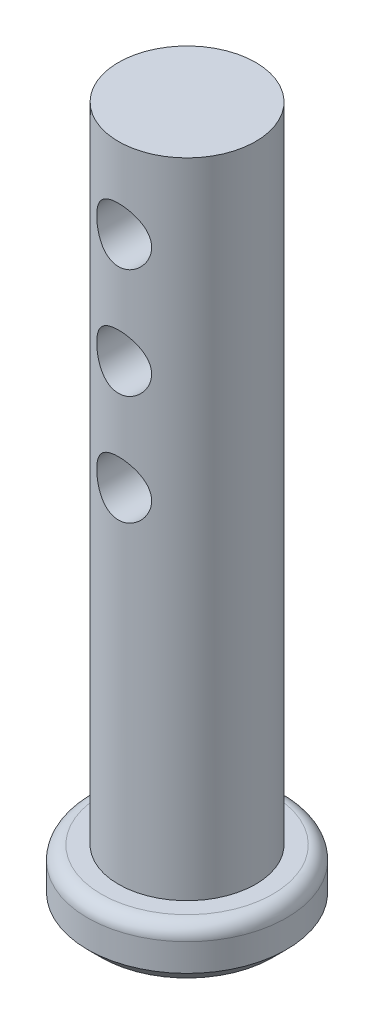
ISO-10303-21;
HEADER;
FILE_DESCRIPTION(('STEP AP214'),'2;1');
FILE_NAME('part.step','',(''),(''),'','','');
FILE_SCHEMA(('AUTOMOTIVE_DESIGN { 1 0 10303 214 1 1 1 1 }'));
ENDSEC;
DATA;
#1=APPLICATION_CONTEXT('core data for automotive mechanical design processes');
#2=APPLICATION_PROTOCOL_DEFINITION('international standard','automotive_design',2000,#1);
#3=PRODUCT_CONTEXT('',#1,'mechanical');
#4=PRODUCT('Part','Part','',(#3));
#5=PRODUCT_RELATED_PRODUCT_CATEGORY('part','',(#4));
#6=PRODUCT_DEFINITION_FORMATION('','',#4);
#7=PRODUCT_DEFINITION_CONTEXT('part definition',#1,'design');
#8=PRODUCT_DEFINITION('design','',#6,#7);
#9=PRODUCT_DEFINITION_SHAPE('','',#8);
#10=(LENGTH_UNIT() NAMED_UNIT(*) SI_UNIT(.MILLI.,.METRE.));
#11=(NAMED_UNIT(*) PLANE_ANGLE_UNIT() SI_UNIT($,.RADIAN.));
#12=(NAMED_UNIT(*) SI_UNIT($,.STERADIAN.) SOLID_ANGLE_UNIT());
#13=UNCERTAINTY_MEASURE_WITH_UNIT(LENGTH_MEASURE(1.E-05),#10,'distance_accuracy_value','');
#14=(GEOMETRIC_REPRESENTATION_CONTEXT(3) GLOBAL_UNCERTAINTY_ASSIGNED_CONTEXT((#13)) GLOBAL_UNIT_ASSIGNED_CONTEXT((#10,
#11,#12)) REPRESENTATION_CONTEXT('',''));
#15=CARTESIAN_POINT('',(0.,0.,0.));
#16=DIRECTION('',(0.,0.,1.));
#17=DIRECTION('',(1.,0.,0.));
#18=AXIS2_PLACEMENT_3D('',#15,#16,#17);
#19=CARTESIAN_POINT('',(0.,2.54,0.));
#20=DIRECTION('',(0.,1.,0.));
#21=DIRECTION('',(0.,0.,1.));
#22=AXIS2_PLACEMENT_3D('',#19,#20,#21);
#23=PLANE('',#22);
#24=CARTESIAN_POINT('',(0.,2.54,0.));
#25=DIRECTION('',(0.,1.,0.));
#26=DIRECTION('',(0.,0.,1.));
#27=AXIS2_PLACEMENT_3D('',#24,#25,#26);
#28=CIRCLE('',#27,3.96875);
#29=CARTESIAN_POINT('',(0.,2.54,3.96875));
#30=VERTEX_POINT('',#29);
#31=EDGE_CURVE('E49',#30,#30,#28,.T.);
#32=ORIENTED_EDGE('',*,*,#31,.T.);
#33=EDGE_LOOP('',(#32));
#34=FACE_BOUND('',#33,.T.);
#35=CARTESIAN_POINT('',(0.,2.54,0.));
#36=DIRECTION('',(0.,1.,0.));
#37=DIRECTION('',(0.,0.,1.));
#38=AXIS2_PLACEMENT_3D('',#35,#36,#37);
#39=CIRCLE('',#38,3.175);
#40=CARTESIAN_POINT('',(0.,2.54,3.175));
#41=VERTEX_POINT('',#40);
#42=EDGE_CURVE('E52',#41,#41,#39,.T.);
#43=ORIENTED_EDGE('',*,*,#42,.F.);
#44=EDGE_LOOP('',(#43));
#45=FACE_BOUND('',#44,.T.);
#46=ADVANCED_FACE('F32',(#34,#45),#23,.T.);
#47=CARTESIAN_POINT('',(0.,2.54,0.));
#48=DIRECTION('',(0.,-1.,0.));
#49=DIRECTION('',(0.,0.,-1.));
#50=AXIS2_PLACEMENT_3D('',#47,#48,#49);
#51=CYLINDRICAL_SURFACE('',#50,4.60375);
#52=CARTESIAN_POINT('',(0.,0.635000000000004,0.));
#53=DIRECTION('',(0.,1.,0.));
#54=DIRECTION('',(0.,0.,1.));
#55=AXIS2_PLACEMENT_3D('',#52,#53,#54);
#56=CIRCLE('',#55,4.60375);
#57=CARTESIAN_POINT('',(0.,0.635000000000004,4.60375));
#58=VERTEX_POINT('',#57);
#59=EDGE_CURVE('E40',#58,#58,#56,.T.);
#60=ORIENTED_EDGE('',*,*,#59,.T.);
#61=EDGE_LOOP('',(#60));
#62=FACE_BOUND('',#61,.T.);
#63=CARTESIAN_POINT('',(0.,1.905,0.));
#64=DIRECTION('',(0.,1.,0.));
#65=DIRECTION('',(0.,0.,1.));
#66=AXIS2_PLACEMENT_3D('',#63,#64,#65);
#67=CIRCLE('',#66,4.60375);
#68=CARTESIAN_POINT('',(0.,1.905,4.60375));
#69=VERTEX_POINT('',#68);
#70=EDGE_CURVE('E44',#69,#69,#67,.F.);
#71=ORIENTED_EDGE('',*,*,#70,.T.);
#72=EDGE_LOOP('',(#71));
#73=FACE_BOUND('',#72,.T.);
#74=ADVANCED_FACE('F127',(#62,#73),#51,.T.);
#75=CARTESIAN_POINT('',(0.,0.,0.));
#76=DIRECTION('',(0.,1.,0.));
#77=DIRECTION('',(0.,0.,1.));
#78=AXIS2_PLACEMENT_3D('',#75,#76,#77);
#79=PLANE('',#78);
#80=CARTESIAN_POINT('',(0.,0.,0.));
#81=DIRECTION('',(0.,1.,0.));
#82=DIRECTION('',(0.,0.,1.));
#83=AXIS2_PLACEMENT_3D('',#80,#81,#82);
#84=CIRCLE('',#83,3.96875);
#85=CARTESIAN_POINT('',(0.,0.,3.96875));
#86=VERTEX_POINT('',#85);
#87=EDGE_CURVE('E10',#86,#86,#84,.F.);
#88=ORIENTED_EDGE('',*,*,#87,.T.);
#89=EDGE_LOOP('',(#88));
#90=FACE_BOUND('',#89,.T.);
#91=ADVANCED_FACE('F109',(#90),#79,.F.);
#92=CARTESIAN_POINT('',(0.,48.26,0.));
#93=DIRECTION('',(0.,-1.,0.));
#94=DIRECTION('',(0.,0.,-1.));
#95=AXIS2_PLACEMENT_3D('',#92,#93,#94);
#96=CYLINDRICAL_SURFACE('',#95,3.175);
#97=CARTESIAN_POINT('',(0.,32.3205337455157,0.));
#98=DIRECTION('',(0.,-1.,0.));
#99=DIRECTION('',(0.,0.,-1.));
#100=AXIS2_PLACEMENT_3D('',#97,#98,#99);
#101=CIRCLE('',#100,3.175);
#102=CARTESIAN_POINT('',(0.,32.3205337455157,-3.175));
#103=VERTEX_POINT('',#102);
#104=EDGE_CURVE('E36',#103,#103,#101,.T.);
#105=ORIENTED_EDGE('',*,*,#104,.T.);
#106=EDGE_LOOP('',(#105));
#107=FACE_BOUND('',#106,.T.);
#108=CARTESIAN_POINT('',(0.,29.845,-3.175));
#109=CARTESIAN_POINT('',(-0.068258058456236,29.8449937440919,-3.17499537229199));
#110=CARTESIAN_POINT('',(-0.136634578197578,29.8394642274239,-3.17277301884902));
#111=CARTESIAN_POINT('',(-0.271460265065364,29.817537708264,-3.16409992718907));
#112=CARTESIAN_POINT('',(-0.337903678751393,29.8011111627803,-3.15763769473787));
#113=CARTESIAN_POINT('',(-0.466695740931903,29.7580836904327,-3.1411812285033));
#114=CARTESIAN_POINT('',(-0.529057020126772,29.7315160726524,-3.13119856591186));
#115=CARTESIAN_POINT('',(-0.648380701158518,29.6690928249377,-3.10868447855509));
#116=CARTESIAN_POINT('',(-0.705344967736885,29.6332404191265,-3.09615393885866));
#117=CARTESIAN_POINT('',(-0.815023139807206,29.5514804584138,-3.06915112718216));
#118=CARTESIAN_POINT('',(-0.867449543069393,29.5052072732875,-3.05461858550036));
#119=CARTESIAN_POINT('',(-0.964041128038309,29.4046909977923,-3.02552466335433));
#120=CARTESIAN_POINT('',(-1.0082022680298,29.3504440312706,-3.01096327228158));
#121=CARTESIAN_POINT('',(-1.08894535023099,29.2325881753962,-2.98273972791181));
#122=CARTESIAN_POINT('',(-1.12510251305914,29.1686700813753,-2.96914643637744));
#123=CARTESIAN_POINT('',(-1.18602424658861,29.0350343870033,-2.94534365963612));
#124=CARTESIAN_POINT('',(-1.21079422832153,28.9653195598163,-2.93513256790051));
#125=CARTESIAN_POINT('',(-1.2470757528564,28.825372668169,-2.91989737114619));
#126=CARTESIAN_POINT('',(-1.25913766828662,28.7553074654091,-2.91465901925808));
#127=CARTESIAN_POINT('',(-1.27137983064145,28.6139667760749,-2.90934142571205));
#128=CARTESIAN_POINT('',(-1.27156592035893,28.5426919019132,-2.90925964706956));
#129=CARTESIAN_POINT('',(-1.26046824836542,28.4062445136242,-2.91408167677795));
#130=CARTESIAN_POINT('',(-1.2499818245838,28.3409925213503,-2.91863891149414));
#131=CARTESIAN_POINT('',(-1.21916626898916,28.2132661819358,-2.93164379130974));
#132=CARTESIAN_POINT('',(-1.19883541970099,28.15079232155,-2.9400921152426));
#133=CARTESIAN_POINT('',(-1.14852115516998,28.0288886740156,-2.96011273031215));
#134=CARTESIAN_POINT('',(-1.11834921257028,27.9695470332003,-2.97174525843298));
#135=CARTESIAN_POINT('',(-1.04934160256501,27.8565509566104,-2.99680703907578));
#136=CARTESIAN_POINT('',(-1.01050268123909,27.8028986680293,-3.01023696565097));
#137=CARTESIAN_POINT('',(-0.921734630653625,27.6984398222108,-3.0386447783134));
#138=CARTESIAN_POINT('',(-0.871180288986414,27.6481738568018,-3.05366207259854));
#139=CARTESIAN_POINT('',(-0.762199661418236,27.5566603564687,-3.08266988848507));
#140=CARTESIAN_POINT('',(-0.703771811487431,27.5154146176445,-3.0966602052278));
#141=CARTESIAN_POINT('',(-0.579169309404779,27.442402920891,-3.12238822602987));
#142=CARTESIAN_POINT('',(-0.512864412005083,27.4108403514399,-3.13407596510587));
#143=CARTESIAN_POINT('',(-0.375300091081701,27.3595034082154,-3.15350415988761));
#144=CARTESIAN_POINT('',(-0.304043204999614,27.3397230461511,-3.16124662048612));
#145=CARTESIAN_POINT('',(-0.163128888631037,27.3136053324085,-3.17154648586888));
#146=CARTESIAN_POINT('',(-0.0936264916808848,27.306541491549,-3.17438370604281));
#147=CARTESIAN_POINT('',(0.0456217717278951,27.3039121811643,-3.17543483854251));
#148=CARTESIAN_POINT('',(0.115367570397124,27.3083437312173,-3.17364994924755));
#149=CARTESIAN_POINT('',(0.249829789342396,27.3280452628705,-3.16584055085484));
#150=CARTESIAN_POINT('',(0.31463138227736,27.3428193175229,-3.16001013504408));
#151=CARTESIAN_POINT('',(0.440775996818531,27.3821116747767,-3.14489745292493));
#152=CARTESIAN_POINT('',(0.502118572992712,27.4066312290896,-3.13561474321398));
#153=CARTESIAN_POINT('',(0.621715028993544,27.4655184366968,-3.11414537679467));
#154=CARTESIAN_POINT('',(0.679817044449623,27.5001643747474,-3.10187858147177));
#155=CARTESIAN_POINT('',(0.789586680441504,27.5780121056801,-3.0757708661341));
#156=CARTESIAN_POINT('',(0.841251708883256,27.6212173272558,-3.06192931625023));
#157=CARTESIAN_POINT('',(0.940259132323243,27.718302458223,-3.03304649700203));
#158=CARTESIAN_POINT('',(0.987090947966796,27.7726987988564,-3.0179863530491));
#159=CARTESIAN_POINT('',(1.07108701035765,27.8888444527109,-2.98920962302381));
#160=CARTESIAN_POINT('',(1.10824966394927,27.9505949752158,-2.97549325859336));
#161=CARTESIAN_POINT('',(1.17208776372654,28.0806281760672,-2.95093580441397));
#162=CARTESIAN_POINT('',(1.19865812752933,28.1489683394998,-2.94012385611842));
#163=CARTESIAN_POINT('',(1.23970809951283,28.2897158688391,-2.92305532658488));
#164=CARTESIAN_POINT('',(1.25419663134598,28.3621201906909,-2.91679538366961));
#165=CARTESIAN_POINT('',(1.26981941697175,28.5033262176268,-2.91002567155455));
#166=CARTESIAN_POINT('',(1.27183964726229,28.5720122231417,-2.9091345234019));
#167=CARTESIAN_POINT('',(1.2647950061412,28.7086959846479,-2.91220420881018));
#168=CARTESIAN_POINT('',(1.25573154232522,28.7766938269281,-2.91616442626245));
#169=CARTESIAN_POINT('',(1.22750031750754,28.9073159405579,-2.92815422165179));
#170=CARTESIAN_POINT('',(1.20874630841755,28.9700463742649,-2.93601668210431));
#171=CARTESIAN_POINT('',(1.16205345979177,29.0914954298045,-2.95480740782763));
#172=CARTESIAN_POINT('',(1.13411208368505,29.1502129382814,-2.96573651965815));
#173=CARTESIAN_POINT('',(1.06798920435241,29.2656321082369,-2.99020617098853));
#174=CARTESIAN_POINT('',(1.02931298782626,29.3220258555328,-3.00386040268909));
#175=CARTESIAN_POINT('',(0.943541495737388,29.4278007564244,-3.03189515776371));
#176=CARTESIAN_POINT('',(0.896443682609497,29.4771797883015,-3.04627589910738));
#177=CARTESIAN_POINT('',(0.791530996483007,29.5708088118224,-3.07526415100495));
#178=CARTESIAN_POINT('',(0.733219260727793,29.6145186898803,-3.08982591305988));
#179=CARTESIAN_POINT('',(0.609536703381468,29.6915440220647,-3.1165825826321));
#180=CARTESIAN_POINT('',(0.544162617887495,29.7248546422168,-3.12877638843996));
#181=CARTESIAN_POINT('',(0.409408669684455,29.7793551066458,-3.14921718908072));
#182=CARTESIAN_POINT('',(0.340126077569508,29.8007591204608,-3.15753345539943));
#183=CARTESIAN_POINT('',(0.198676606888577,29.831435841806,-3.16956634442947));
#184=CARTESIAN_POINT('',(0.126519638920411,29.8407470473324,-3.1732975617973));
#185=CARTESIAN_POINT('',(0.0361393091607415,29.8446160669212,-3.17484696185127));
#186=CARTESIAN_POINT('',(0.0180738073503822,29.8450016564795,-3.17500122535427));
#187=CARTESIAN_POINT('',(0.,29.845,-3.175));
#188=B_SPLINE_CURVE_WITH_KNOTS('',3,(#108,#109,#110,#111,#112,#113,#114,#115,#116,#117,#118,
#119,#120,#121,#122,#123,#124,#125,#126,#127,#128,#129,#130,#131,#132,#133,#134,#135,#136,#137,
#138,#139,#140,#141,#142,#143,#144,#145,#146,#147,#148,#149,#150,#151,#152,#153,#154,#155,#156,
#157,#158,#159,#160,#161,#162,#163,#164,#165,#166,#167,#168,#169,#170,#171,#172,#173,#174,#175,
#176,#177,#178,#179,#180,#181,#182,#183,#184,#185,#186,#187),.UNSPECIFIED.,.T.,.F.,(4,2,2,2,2,2,
2,2,2,2,2,2,2,2,2,2,2,2,2,2,2,2,2,2,2,2,2,2,2,2,2,2,2,2,2,2,2,2,2,4),(0.,0.2047258973121,
0.410009108865038,0.614623775494453,0.819167485156699,1.03249337379752,1.24592330783351,
1.46885189350202,1.691674436801,1.90439106871107,2.1170030452621,2.31481838534871,
2.5126682490759,2.71455595199748,2.91651957930746,3.13409551733464,3.3517147395323,
3.57363339858382,3.79543917132257,4.00411432175285,4.21273537417003,4.41198289283373,
4.61125601111061,4.81662431007897,5.02207504281845,5.24108981386503,5.4601406484278,
5.68131353664425,5.90232292130168,6.10742792604395,6.31250688577534,6.50947592278468,
6.70649938736278,6.91480372216,7.1231709285623,7.34504768943986,7.56702743411739,
7.78487331143458,8.00202395276757,8.05623259144465),.UNSPECIFIED.);
#189=CARTESIAN_POINT('',(0.,29.845,-3.175));
#190=VERTEX_POINT('',#189);
#191=EDGE_CURVE('E53',#190,#190,#188,.T.);
#192=ORIENTED_EDGE('',*,*,#191,.T.);
#193=EDGE_LOOP('',(#192));
#194=FACE_BOUND('',#193,.T.);
#195=CARTESIAN_POINT('',(1.26999999999997,28.575,2.90993556629697));
#196=CARTESIAN_POINT('',(1.26999254141937,28.5069664187066,2.90994243801829));
#197=CARTESIAN_POINT('',(1.26450078480738,28.4388366104625,2.9123551257751));
#198=CARTESIAN_POINT('',(1.24273883442635,28.3045313811231,2.92170430509283));
#199=CARTESIAN_POINT('',(1.22644109832072,28.2383614066539,2.92865235570652));
#200=CARTESIAN_POINT('',(1.18378924568109,28.110146381849,2.94614889427475));
#201=CARTESIAN_POINT('',(1.15747301685361,28.0480868124262,2.95668380186769));
#202=CARTESIAN_POINT('',(1.09564187105094,27.9292779927041,2.98014812335504));
#203=CARTESIAN_POINT('',(1.06012896258483,27.8725275865892,2.99307701423992));
#204=CARTESIAN_POINT('',(0.978739453862976,27.7626696445767,3.02070049307407));
#205=CARTESIAN_POINT('',(0.932420892156818,27.7099036714398,3.03545187903805));
#206=CARTESIAN_POINT('',(0.831665282166482,27.6126390867047,3.06458910181546));
#207=CARTESIAN_POINT('',(0.777225408764021,27.5681433641809,3.07897480937597));
#208=CARTESIAN_POINT('',(0.659134007076263,27.486986937916,3.10644164020853));
#209=CARTESIAN_POINT('',(0.595203893163761,27.4507043685661,3.11944895339067));
#210=CARTESIAN_POINT('',(0.461534080025664,27.3895543340725,3.14200494046033));
#211=CARTESIAN_POINT('',(0.391796758497819,27.3646822239285,3.15155502139268));
#212=CARTESIAN_POINT('',(0.25207368104266,27.3282781561123,3.16571836380261));
#213=CARTESIAN_POINT('',(0.182263405350889,27.3161586555535,3.17054824852352));
#214=CARTESIAN_POINT('',(0.0414441186848736,27.3037119116042,3.17550997283516));
#215=CARTESIAN_POINT('',(-0.0295644352991653,27.3033802699814,3.17564356468514));
#216=CARTESIAN_POINT('',(-0.166517634144258,27.3141965588071,3.17132946391834));
#217=CARTESIAN_POINT('',(-0.232522682575047,27.3247007306943,3.16713867950116));
#218=CARTESIAN_POINT('',(-0.36174242435368,27.3557954764573,3.15499300082681));
#219=CARTESIAN_POINT('',(-0.424956912587786,27.3763867904242,3.14703783037906));
#220=CARTESIAN_POINT('',(-0.547940190954937,27.4273241666265,3.12798983530639));
#221=CARTESIAN_POINT('',(-0.607642690846103,27.4578125689079,3.11685152896417));
#222=CARTESIAN_POINT('',(-0.721238175720301,27.5275452793936,3.09254261589107));
#223=CARTESIAN_POINT('',(-0.775129160124765,27.566792588617,3.07937131308321));
#224=CARTESIAN_POINT('',(-0.879328205775052,27.6559322013261,3.05131239608241));
#225=CARTESIAN_POINT('',(-0.929168731748799,27.7063542217907,3.03636887340351));
#226=CARTESIAN_POINT('',(-1.01987820876972,27.8148990131063,3.00711654712633));
#227=CARTESIAN_POINT('',(-1.06074422328742,27.8730242945779,2.99280795249979));
#228=CARTESIAN_POINT('',(-1.1334141598518,27.9974160792297,2.96606529875549));
#229=CARTESIAN_POINT('',(-1.1649295038517,28.0638661673572,2.95369560505175));
#230=CARTESIAN_POINT('',(-1.21613692507861,28.2017568364434,2.93298619946749));
#231=CARTESIAN_POINT('',(-1.23583668148683,28.2731941423295,2.92464387081319));
#232=CARTESIAN_POINT('',(-1.26171639250833,28.4143677186719,2.91356897392077));
#233=CARTESIAN_POINT('',(-1.26864878147337,28.4839412839213,2.91052482694526));
#234=CARTESIAN_POINT('',(-1.27099144229516,28.6233090269327,2.90950331151956));
#235=CARTESIAN_POINT('',(-1.26640520822651,28.6931031313814,2.91152440657163));
#236=CARTESIAN_POINT('',(-1.24652588819075,28.8267514236964,2.92008588166777));
#237=CARTESIAN_POINT('',(-1.23185749438493,28.8907175152487,2.92636230701582));
#238=CARTESIAN_POINT('',(-1.1930406586887,29.0152381370391,2.94239982402697));
#239=CARTESIAN_POINT('',(-1.16889011478205,29.0757919074231,2.95216168830351));
#240=CARTESIAN_POINT('',(-1.11070113107076,29.1945074972001,2.97455451481067));
#241=CARTESIAN_POINT('',(-1.07630142134805,29.252472729821,2.98728577445849));
#242=CARTESIAN_POINT('',(-0.998959917520622,29.3620716970255,3.01402994575226));
#243=CARTESIAN_POINT('',(-0.956014644661092,29.4137028392252,3.02804337808999));
#244=CARTESIAN_POINT('',(-0.85905607441714,29.5131321144605,3.05702281641836));
#245=CARTESIAN_POINT('',(-0.804459547697671,29.5603654189598,3.07198272626102));
#246=CARTESIAN_POINT('',(-0.687758107189249,29.6450874436476,3.10019569550402));
#247=CARTESIAN_POINT('',(-0.625652887927127,29.6825757671892,3.11344868541707));
#248=CARTESIAN_POINT('',(-0.495477758091151,29.7466052428029,3.13679659596681));
#249=CARTESIAN_POINT('',(-0.427409280431264,29.7731490160453,3.14689227262573));
#250=CARTESIAN_POINT('',(-0.28726993023374,29.8142335212788,3.16276173052999));
#251=CARTESIAN_POINT('',(-0.215201252536894,29.8287807674144,3.1685378571429));
#252=CARTESIAN_POINT('',(-0.0741784840699358,29.8446854855321,3.17486670213675));
#253=CARTESIAN_POINT('',(-0.00532796279662326,29.8468415815738,3.17573562682994));
#254=CARTESIAN_POINT('',(0.131720485690577,29.8400117706546,3.17300636910406));
#255=CARTESIAN_POINT('',(0.199918510115553,29.8310275503061,3.1694088628899));
#256=CARTESIAN_POINT('',(0.331578522735939,29.8027427893924,3.15830910986302));
#257=CARTESIAN_POINT('',(0.395121640951693,29.783767619242,3.150930202028));
#258=CARTESIAN_POINT('',(0.518110695271896,29.7363814691032,3.13305791873344));
#259=CARTESIAN_POINT('',(0.577555873249689,29.7079687487771,3.12256396888048));
#260=CARTESIAN_POINT('',(0.6935489315786,29.6410994689593,3.09891489918637));
#261=CARTESIAN_POINT('',(0.749852695622046,29.602254552748,3.08566267377427));
#262=CARTESIAN_POINT('',(0.855379308112752,29.5162042903214,3.05809271023395));
#263=CARTESIAN_POINT('',(0.904599210448522,29.4689954837478,3.04377453252069));
#264=CARTESIAN_POINT('',(0.997712803329573,29.3641048324266,3.01458479860234));
#265=CARTESIAN_POINT('',(1.04108814337135,29.3059555653903,2.9997338570442));
#266=CARTESIAN_POINT('',(1.11750313102899,29.1827317427327,2.97211541386741));
#267=CARTESIAN_POINT('',(1.15054156346646,29.1176563741022,2.95934815728535));
#268=CARTESIAN_POINT('',(1.20268434067252,28.9883613768265,2.93851878930773));
#269=CARTESIAN_POINT('',(1.22277347149424,28.924589575933,2.93013713318398));
#270=CARTESIAN_POINT('',(1.25267577621464,28.7944017585347,2.91748212288518));
#271=CARTESIAN_POINT('',(1.26251758410886,28.727993651361,2.91319732365833));
#272=CARTESIAN_POINT('',(1.26902480402693,28.6325452479154,2.91036031311099));
#273=CARTESIAN_POINT('',(1.27000315531172,28.6037812346665,2.90993265925283));
#274=CARTESIAN_POINT('',(1.26999999999997,28.575,2.90993556629697));
#275=B_SPLINE_CURVE_WITH_KNOTS('',3,(#195,#196,#197,#198,#199,#200,#201,#202,#203,#204,#205,
#206,#207,#208,#209,#210,#211,#212,#213,#214,#215,#216,#217,#218,#219,#220,#221,#222,#223,#224,
#225,#226,#227,#228,#229,#230,#231,#232,#233,#234,#235,#236,#237,#238,#239,#240,#241,#242,#243,
#244,#245,#246,#247,#248,#249,#250,#251,#252,#253,#254,#255,#256,#257,#258,#259,#260,#261,#262,
#263,#264,#265,#266,#267,#268,#269,#270,#271,#272,#273,#274),.UNSPECIFIED.,.T.,.F.,(4,2,2,2,2,2,
2,2,2,2,2,2,2,2,2,2,2,2,2,2,2,2,2,2,2,2,2,2,2,2,2,2,2,2,2,2,2,2,2,4),(0.,0.204011306967464,
0.408544608247129,0.612311972791306,0.816034873031526,1.0303231761061,1.24468619711198,
1.46750194873057,1.6902269152562,1.90216906133362,2.11403212769102,2.31399489467242,
2.51397233506953,2.71696370649161,2.9200247348692,3.13641767991661,3.35288132525726,
3.57545931283757,3.79789248544261,4.00673663674204,4.21551744462738,4.41240702530263,
4.60934027739986,4.81425983200662,5.01926297720111,5.23940871243028,5.45956340677691,
5.67966534439832,5.89964768727073,6.10527760241227,6.31087638956699,6.51015966467725,
6.70947970917348,6.91760777470049,7.12582215014467,7.34692620832561,7.56805624913281,
7.7693307961631,7.97004140185417,8.05634727005666),.UNSPECIFIED.);
#276=CARTESIAN_POINT('',(1.26999999999997,28.575,2.90993556629697));
#277=VERTEX_POINT('',#276);
#278=EDGE_CURVE('E62',#277,#277,#275,.T.);
#279=ORIENTED_EDGE('',*,*,#278,.T.);
#280=EDGE_LOOP('',(#279));
#281=FACE_BOUND('',#280,.T.);
#282=CARTESIAN_POINT('',(0.,24.765,-3.175));
#283=CARTESIAN_POINT('',(-0.0682580584562359,24.7649937440919,-3.17499537229199));
#284=CARTESIAN_POINT('',(-0.136634578197577,24.7594642274239,-3.17277301884902));
#285=CARTESIAN_POINT('',(-0.271460265065364,24.737537708264,-3.16409992718907));
#286=CARTESIAN_POINT('',(-0.337903678751393,24.7211111627803,-3.15763769473787));
#287=CARTESIAN_POINT('',(-0.466695740931902,24.6780836904327,-3.1411812285033));
#288=CARTESIAN_POINT('',(-0.529057020126771,24.6515160726524,-3.13119856591186));
#289=CARTESIAN_POINT('',(-0.648380701158516,24.5890928249377,-3.1086844785551));
#290=CARTESIAN_POINT('',(-0.705344967736883,24.5532404191265,-3.09615393885866));
#291=CARTESIAN_POINT('',(-0.815023139807204,24.4714804584138,-3.06915112718216));
#292=CARTESIAN_POINT('',(-0.867449543069391,24.4252072732874,-3.05461858550036));
#293=CARTESIAN_POINT('',(-0.964041128038305,24.3246909977923,-3.02552466335433));
#294=CARTESIAN_POINT('',(-1.0082022680298,24.2704440312706,-3.01096327228158));
#295=CARTESIAN_POINT('',(-1.08894535023099,24.1525881753962,-2.98273972791181));
#296=CARTESIAN_POINT('',(-1.12510251305914,24.0886700813753,-2.96914643637744));
#297=CARTESIAN_POINT('',(-1.1860242465886,23.9550343870033,-2.94534365963613));
#298=CARTESIAN_POINT('',(-1.21079422832152,23.8853195598163,-2.93513256790051));
#299=CARTESIAN_POINT('',(-1.24707575285639,23.745372668169,-2.91989737114619));
#300=CARTESIAN_POINT('',(-1.2591376682866,23.6753074654091,-2.91465901925808));
#301=CARTESIAN_POINT('',(-1.27137983064144,23.5339667760749,-2.90934142571206));
#302=CARTESIAN_POINT('',(-1.27156592035891,23.4626919019131,-2.90925964706957));
#303=CARTESIAN_POINT('',(-1.26046824836541,23.3262445136242,-2.91408167677795));
#304=CARTESIAN_POINT('',(-1.24998182458378,23.2609925213503,-2.91863891149415));
#305=CARTESIAN_POINT('',(-1.21916626898914,23.1332661819358,-2.93164379130975));
#306=CARTESIAN_POINT('',(-1.19883541970096,23.07079232155,-2.94009211524261));
#307=CARTESIAN_POINT('',(-1.14852115516996,22.9488886740155,-2.96011273031216));
#308=CARTESIAN_POINT('',(-1.11834921257025,22.8895470332003,-2.97174525843299));
#309=CARTESIAN_POINT('',(-1.04934160256498,22.7765509566104,-2.99680703907579));
#310=CARTESIAN_POINT('',(-1.01050268123907,22.7228986680292,-3.01023696565098));
#311=CARTESIAN_POINT('',(-0.921734630653596,22.6184398222107,-3.03864477831341));
#312=CARTESIAN_POINT('',(-0.871180288986385,22.5681738568018,-3.05366207259855));
#313=CARTESIAN_POINT('',(-0.762199661418206,22.4766603564687,-3.08266988848508));
#314=CARTESIAN_POINT('',(-0.703771811487399,22.4354146176445,-3.0966602052278));
#315=CARTESIAN_POINT('',(-0.579169309404745,22.362402920891,-3.12238822602988));
#316=CARTESIAN_POINT('',(-0.512864412005048,22.3308403514399,-3.13407596510588));
#317=CARTESIAN_POINT('',(-0.375300091081666,22.2795034082154,-3.15350415988761));
#318=CARTESIAN_POINT('',(-0.30404320499958,22.2597230461511,-3.16124662048612));
#319=CARTESIAN_POINT('',(-0.163128888631002,22.2336053324085,-3.17154648586888));
#320=CARTESIAN_POINT('',(-0.0936264916808505,22.226541491549,-3.17438370604281));
#321=CARTESIAN_POINT('',(0.0456217717279294,22.2239121811643,-3.17543483854251));
#322=CARTESIAN_POINT('',(0.115367570397158,22.2283437312173,-3.17364994924755));
#323=CARTESIAN_POINT('',(0.24982978934243,22.2480452628705,-3.16584055085483));
#324=CARTESIAN_POINT('',(0.314631382277395,22.2628193175229,-3.16001013504408));
#325=CARTESIAN_POINT('',(0.440775996818565,22.3021116747767,-3.14489745292493));
#326=CARTESIAN_POINT('',(0.502118572992746,22.3266312290896,-3.13561474321397));
#327=CARTESIAN_POINT('',(0.621715028993576,22.3855184366968,-3.11414537679466));
#328=CARTESIAN_POINT('',(0.679817044449653,22.4201643747474,-3.10187858147176));
#329=CARTESIAN_POINT('',(0.789586680441534,22.4980121056801,-3.07577086613409));
#330=CARTESIAN_POINT('',(0.841251708883286,22.5412173272559,-3.06192931625022));
#331=CARTESIAN_POINT('',(0.940259132323273,22.638302458223,-3.03304649700202));
#332=CARTESIAN_POINT('',(0.987090947966825,22.6926987988564,-3.01798635304909));
#333=CARTESIAN_POINT('',(1.07108701035768,22.8088444527109,-2.9892096230238));
#334=CARTESIAN_POINT('',(1.10824966394929,22.8705949752159,-2.97549325859335));
#335=CARTESIAN_POINT('',(1.17208776372656,23.0006281760672,-2.95093580441396));
#336=CARTESIAN_POINT('',(1.19865812752936,23.0689683394998,-2.94012385611841));
#337=CARTESIAN_POINT('',(1.23970809951285,23.2097158688391,-2.92305532658487));
#338=CARTESIAN_POINT('',(1.254196631346,23.2821201906909,-2.9167953836696));
#339=CARTESIAN_POINT('',(1.26981941697177,23.4233262176268,-2.91002567155454));
#340=CARTESIAN_POINT('',(1.27183964726231,23.4920122231418,-2.90913452340189));
#341=CARTESIAN_POINT('',(1.26479500614122,23.6286959846479,-2.91220420881018));
#342=CARTESIAN_POINT('',(1.25573154232524,23.6966938269281,-2.91616442626244));
#343=CARTESIAN_POINT('',(1.22750031750756,23.8273159405579,-2.92815422165178));
#344=CARTESIAN_POINT('',(1.20874630841756,23.8900463742649,-2.93601668210431));
#345=CARTESIAN_POINT('',(1.16205345979179,24.0114954298046,-2.95480740782763));
#346=CARTESIAN_POINT('',(1.13411208368506,24.0702129382814,-2.96573651965815));
#347=CARTESIAN_POINT('',(1.06798920435242,24.1856321082369,-2.99020617098852));
#348=CARTESIAN_POINT('',(1.02931298782627,24.2420258555328,-3.00386040268909));
#349=CARTESIAN_POINT('',(0.943541495737396,24.3478007564244,-3.03189515776371));
#350=CARTESIAN_POINT('',(0.896443682609506,24.3971797883015,-3.04627589910738));
#351=CARTESIAN_POINT('',(0.791530996483015,24.4908088118224,-3.07526415100495));
#352=CARTESIAN_POINT('',(0.733219260727799,24.5345186898803,-3.08982591305988));
#353=CARTESIAN_POINT('',(0.609536703381472,24.6115440220647,-3.1165825826321));
#354=CARTESIAN_POINT('',(0.544162617887499,24.6448546422168,-3.12877638843995));
#355=CARTESIAN_POINT('',(0.409408669684458,24.6993551066458,-3.14921718908072));
#356=CARTESIAN_POINT('',(0.34012607756951,24.7207591204608,-3.15753345539943));
#357=CARTESIAN_POINT('',(0.198676606888578,24.751435841806,-3.16956634442947));
#358=CARTESIAN_POINT('',(0.126519638920412,24.7607470473324,-3.1732975617973));
#359=CARTESIAN_POINT('',(0.0361393091607421,24.7646160669212,-3.17484696185127));
#360=CARTESIAN_POINT('',(0.0180738073503825,24.7650016564795,-3.17500122535427));
#361=CARTESIAN_POINT('',(0.,24.765,-3.175));
#362=B_SPLINE_CURVE_WITH_KNOTS('',3,(#282,#283,#284,#285,#286,#287,#288,#289,#290,#291,#292,
#293,#294,#295,#296,#297,#298,#299,#300,#301,#302,#303,#304,#305,#306,#307,#308,#309,#310,#311,
#312,#313,#314,#315,#316,#317,#318,#319,#320,#321,#322,#323,#324,#325,#326,#327,#328,#329,#330,
#331,#332,#333,#334,#335,#336,#337,#338,#339,#340,#341,#342,#343,#344,#345,#346,#347,#348,#349,
#350,#351,#352,#353,#354,#355,#356,#357,#358,#359,#360,#361),.UNSPECIFIED.,.T.,.F.,(4,2,2,2,2,2,
2,2,2,2,2,2,2,2,2,2,2,2,2,2,2,2,2,2,2,2,2,2,2,2,2,2,2,2,2,2,2,2,2,4),(0.,0.2047258973121,
0.410009108865038,0.614623775494455,0.819167485156701,1.03249337379752,1.24592330783351,
1.46885189350203,1.691674436801,1.90439106871106,2.1170030452621,2.31481838534871,
2.5126682490759,2.71455595199748,2.91651957930746,3.13409551733463,3.3517147395323,
3.57363339858382,3.79543917132257,4.00411432175285,4.21273537417003,4.41198289283373,
4.61125601111061,4.81662431007897,5.02207504281846,5.24108981386503,5.4601406484278,
5.68131353664426,5.90232292130168,6.10742792604395,6.31250688577534,6.50947592278469,
6.70649938736279,6.91480372216,7.1231709285623,7.34504768943986,7.56702743411739,
7.78487331143458,8.00202395276758,8.05623259144466),.UNSPECIFIED.);
#363=CARTESIAN_POINT('',(0.,24.765,-3.175));
#364=VERTEX_POINT('',#363);
#365=EDGE_CURVE('E92',#364,#364,#362,.T.);
#366=ORIENTED_EDGE('',*,*,#365,.T.);
#367=EDGE_LOOP('',(#366));
#368=FACE_BOUND('',#367,.T.);
#369=CARTESIAN_POINT('',(1.26999999999999,23.495,2.90993556629696));
#370=CARTESIAN_POINT('',(1.26999254141939,23.4269664187066,2.90994243801828));
#371=CARTESIAN_POINT('',(1.2645007848074,23.3588366104625,2.91235512577509));
#372=CARTESIAN_POINT('',(1.24273883442637,23.2245313811231,2.92170430509282));
#373=CARTESIAN_POINT('',(1.22644109832074,23.1583614066539,2.92865235570651));
#374=CARTESIAN_POINT('',(1.18378924568111,23.030146381849,2.94614889427474));
#375=CARTESIAN_POINT('',(1.15747301685363,22.9680868124262,2.95668380186769));
#376=CARTESIAN_POINT('',(1.09564187105096,22.8492779927041,2.98014812335504));
#377=CARTESIAN_POINT('',(1.06012896258485,22.7925275865892,2.99307701423992));
#378=CARTESIAN_POINT('',(0.978739453862995,22.6826696445767,3.02070049307406));
#379=CARTESIAN_POINT('',(0.932420892156837,22.6299036714398,3.03545187903804));
#380=CARTESIAN_POINT('',(0.831665282166501,22.5326390867047,3.06458910181545));
#381=CARTESIAN_POINT('',(0.77722540876404,22.4881433641809,3.07897480937597));
#382=CARTESIAN_POINT('',(0.659134007076283,22.406986937916,3.10644164020853));
#383=CARTESIAN_POINT('',(0.595203893163782,22.3707043685661,3.11944895339066));
#384=CARTESIAN_POINT('',(0.461534080025684,22.3095543340725,3.14200494046032));
#385=CARTESIAN_POINT('',(0.391796758497838,22.2846822239285,3.15155502139268));
#386=CARTESIAN_POINT('',(0.252073681042678,22.2482781561123,3.16571836380261));
#387=CARTESIAN_POINT('',(0.182263405350906,22.2361586555535,3.17054824852352));
#388=CARTESIAN_POINT('',(0.0414441186848899,22.2237119116042,3.17550997283516));
#389=CARTESIAN_POINT('',(-0.0295644352991496,22.2233802699814,3.17564356468514));
#390=CARTESIAN_POINT('',(-0.166517634144242,22.2341965588071,3.17132946391834));
#391=CARTESIAN_POINT('',(-0.23252268257503,22.2447007306943,3.16713867950116));
#392=CARTESIAN_POINT('',(-0.361742424353662,22.2757954764573,3.15499300082682));
#393=CARTESIAN_POINT('',(-0.424956912587768,22.2963867904242,3.14703783037906));
#394=CARTESIAN_POINT('',(-0.54794019095492,22.3473241666265,3.12798983530639));
#395=CARTESIAN_POINT('',(-0.607642690846087,22.3778125689079,3.11685152896418));
#396=CARTESIAN_POINT('',(-0.721238175720284,22.4475452793936,3.09254261589108));
#397=CARTESIAN_POINT('',(-0.775129160124747,22.486792588617,3.07937131308321));
#398=CARTESIAN_POINT('',(-0.879328205775035,22.5759322013261,3.05131239608241));
#399=CARTESIAN_POINT('',(-0.929168731748782,22.6263542217907,3.03636887340352));
#400=CARTESIAN_POINT('',(-1.0198782087697,22.7348990131063,3.00711654712634));
#401=CARTESIAN_POINT('',(-1.0607442232874,22.7930242945779,2.9928079524998));
#402=CARTESIAN_POINT('',(-1.13341415985178,22.9174160792297,2.9660652987555));
#403=CARTESIAN_POINT('',(-1.16492950385168,22.9838661673572,2.95369560505176));
#404=CARTESIAN_POINT('',(-1.2161369250786,23.1217568364434,2.9329861994675));
#405=CARTESIAN_POINT('',(-1.23583668148681,23.1931941423295,2.9246438708132));
#406=CARTESIAN_POINT('',(-1.26171639250831,23.3343677186719,2.91356897392078));
#407=CARTESIAN_POINT('',(-1.26864878147336,23.4039412839213,2.91052482694527));
#408=CARTESIAN_POINT('',(-1.27099144229514,23.5433090269327,2.90950331151957));
#409=CARTESIAN_POINT('',(-1.2664052082265,23.6131031313814,2.91152440657163));
#410=CARTESIAN_POINT('',(-1.24652588819073,23.7467514236964,2.92008588166778));
#411=CARTESIAN_POINT('',(-1.23185749438491,23.8107175152487,2.92636230701583));
#412=CARTESIAN_POINT('',(-1.19304065868868,23.9352381370391,2.94239982402698));
#413=CARTESIAN_POINT('',(-1.16889011478204,23.9957919074232,2.95216168830352));
#414=CARTESIAN_POINT('',(-1.11070113107074,24.1145074972001,2.97455451481068));
#415=CARTESIAN_POINT('',(-1.07630142134803,24.172472729821,2.9872857744585));
#416=CARTESIAN_POINT('',(-0.998959917520607,24.2820716970255,3.01402994575226));
#417=CARTESIAN_POINT('',(-0.956014644661076,24.3337028392252,3.02804337808999));
#418=CARTESIAN_POINT('',(-0.859056074417124,24.4331321144605,3.05702281641837));
#419=CARTESIAN_POINT('',(-0.804459547697655,24.4803654189598,3.07198272626103));
#420=CARTESIAN_POINT('',(-0.687758107189232,24.5650874436476,3.10019569550402));
#421=CARTESIAN_POINT('',(-0.625652887927109,24.6025757671892,3.11344868541707));
#422=CARTESIAN_POINT('',(-0.495477758091133,24.6666052428029,3.13679659596681));
#423=CARTESIAN_POINT('',(-0.427409280431247,24.6931490160453,3.14689227262574));
#424=CARTESIAN_POINT('',(-0.287269930233723,24.7342335212789,3.16276173052999));
#425=CARTESIAN_POINT('',(-0.215201252536875,24.7487807674144,3.1685378571429));
#426=CARTESIAN_POINT('',(-0.0741784840699162,24.7646854855321,3.17486670213675));
#427=CARTESIAN_POINT('',(-0.00532796279660385,24.7668415815738,3.17573562682994));
#428=CARTESIAN_POINT('',(0.131720485690596,24.7600117706546,3.17300636910406));
#429=CARTESIAN_POINT('',(0.199918510115572,24.7510275503061,3.16940886288989));
#430=CARTESIAN_POINT('',(0.331578522735958,24.7227427893924,3.15830910986302));
#431=CARTESIAN_POINT('',(0.395121640951712,24.703767619242,3.150930202028));
#432=CARTESIAN_POINT('',(0.518110695271914,24.6563814691032,3.13305791873344));
#433=CARTESIAN_POINT('',(0.577555873249707,24.6279687487771,3.12256396888048));
#434=CARTESIAN_POINT('',(0.69354893157862,24.5610994689593,3.09891489918637));
#435=CARTESIAN_POINT('',(0.749852695622068,24.522254552748,3.08566267377426));
#436=CARTESIAN_POINT('',(0.855379308112774,24.4362042903214,3.05809271023394));
#437=CARTESIAN_POINT('',(0.904599210448542,24.3889954837478,3.04377453252068));
#438=CARTESIAN_POINT('',(0.997712803329591,24.2841048324266,3.01458479860234));
#439=CARTESIAN_POINT('',(1.04108814337137,24.2259555653903,2.99973385704419));
#440=CARTESIAN_POINT('',(1.117503131029,24.1027317427327,2.9721154138674));
#441=CARTESIAN_POINT('',(1.15054156346648,24.0376563741022,2.95934815728535));
#442=CARTESIAN_POINT('',(1.20268434067254,23.9083613768265,2.93851878930772));
#443=CARTESIAN_POINT('',(1.22277347149426,23.844589575933,2.93013713318397));
#444=CARTESIAN_POINT('',(1.25267577621466,23.7144017585347,2.91748212288518));
#445=CARTESIAN_POINT('',(1.26251758410888,23.647993651361,2.91319732365832));
#446=CARTESIAN_POINT('',(1.26902480402695,23.5525452479154,2.91036031311099));
#447=CARTESIAN_POINT('',(1.27000315531173,23.5237812346665,2.90993265925282));
#448=CARTESIAN_POINT('',(1.26999999999999,23.495,2.90993556629696));
#449=B_SPLINE_CURVE_WITH_KNOTS('',3,(#369,#370,#371,#372,#373,#374,#375,#376,#377,#378,#379,
#380,#381,#382,#383,#384,#385,#386,#387,#388,#389,#390,#391,#392,#393,#394,#395,#396,#397,#398,
#399,#400,#401,#402,#403,#404,#405,#406,#407,#408,#409,#410,#411,#412,#413,#414,#415,#416,#417,
#418,#419,#420,#421,#422,#423,#424,#425,#426,#427,#428,#429,#430,#431,#432,#433,#434,#435,#436,
#437,#438,#439,#440,#441,#442,#443,#444,#445,#446,#447,#448),.UNSPECIFIED.,.T.,.F.,(4,2,2,2,2,2,
2,2,2,2,2,2,2,2,2,2,2,2,2,2,2,2,2,2,2,2,2,2,2,2,2,2,2,2,2,2,2,2,2,4),(0.,0.204011306967464,
0.408544608247129,0.612311972791306,0.816034873031523,1.0303231761061,1.24468619711198,
1.46750194873057,1.6902269152562,1.90216906133362,2.11403212769102,2.31399489467242,
2.51397233506953,2.71696370649161,2.9200247348692,3.13641767991662,3.35288132525727,
3.57545931283757,3.79789248544262,4.00673663674205,4.21551744462739,4.41240702530264,
4.60934027739987,4.81425983200662,5.01926297720111,5.23940871243029,5.45956340677692,
5.67966534439833,5.89964768727074,6.10527760241227,6.31087638956699,6.51015966467726,
6.70947970917349,6.9176077747005,7.12582215014468,7.34692620832562,7.56805624913282,
7.76933079616311,7.97004140185417,8.05634727005667),.UNSPECIFIED.);
#450=CARTESIAN_POINT('',(1.26999999999999,23.495,2.90993556629696));
#451=VERTEX_POINT('',#450);
#452=EDGE_CURVE('E61',#451,#451,#449,.T.);
#453=ORIENTED_EDGE('',*,*,#452,.T.);
#454=EDGE_LOOP('',(#453));
#455=FACE_BOUND('',#454,.T.);
#456=CARTESIAN_POINT('',(0.,19.685,-3.175));
#457=CARTESIAN_POINT('',(-0.0682580584562362,19.6849937440919,-3.17499537229199));
#458=CARTESIAN_POINT('',(-0.136634578197578,19.6794642274239,-3.17277301884902));
#459=CARTESIAN_POINT('',(-0.271460265065364,19.657537708264,-3.16409992718907));
#460=CARTESIAN_POINT('',(-0.337903678751393,19.6411111627803,-3.15763769473787));
#461=CARTESIAN_POINT('',(-0.466695740931901,19.5980836904326,-3.1411812285033));
#462=CARTESIAN_POINT('',(-0.529057020126769,19.5715160726524,-3.13119856591186));
#463=CARTESIAN_POINT('',(-0.648380701158513,19.5090928249376,-3.1086844785551));
#464=CARTESIAN_POINT('',(-0.70534496773688,19.4732404191265,-3.09615393885866));
#465=CARTESIAN_POINT('',(-0.8150231398072,19.3914804584138,-3.06915112718216));
#466=CARTESIAN_POINT('',(-0.867449543069385,19.3452072732874,-3.05461858550036));
#467=CARTESIAN_POINT('',(-0.964041128038298,19.2446909977922,-3.02552466335433));
#468=CARTESIAN_POINT('',(-1.00820226802979,19.1904440312705,-3.01096327228158));
#469=CARTESIAN_POINT('',(-1.08894535023098,19.0725881753962,-2.98273972791182));
#470=CARTESIAN_POINT('',(-1.12510251305913,19.0086700813753,-2.96914643637744));
#471=CARTESIAN_POINT('',(-1.18602424658859,18.8750343870033,-2.94534365963613));
#472=CARTESIAN_POINT('',(-1.21079422832151,18.8053195598163,-2.93513256790052));
#473=CARTESIAN_POINT('',(-1.24707575285638,18.665372668169,-2.9198973711462));
#474=CARTESIAN_POINT('',(-1.25913766828659,18.5953074654091,-2.91465901925809));
#475=CARTESIAN_POINT('',(-1.27137983064142,18.4539667760749,-2.90934142571206));
#476=CARTESIAN_POINT('',(-1.2715659203589,18.3826919019131,-2.90925964706958));
#477=CARTESIAN_POINT('',(-1.26046824836538,18.2462445136241,-2.91408167677796));
#478=CARTESIAN_POINT('',(-1.24998182458376,18.1809925213503,-2.91863891149416));
#479=CARTESIAN_POINT('',(-1.21916626898911,18.0532661819357,-2.93164379130976));
#480=CARTESIAN_POINT('',(-1.19883541970094,17.99079232155,-2.94009211524262));
#481=CARTESIAN_POINT('',(-1.14852115516993,17.8688886740155,-2.96011273031217));
#482=CARTESIAN_POINT('',(-1.11834921257022,17.8095470332003,-2.971745258433));
#483=CARTESIAN_POINT('',(-1.04934160256495,17.6965509566104,-2.9968070390758));
#484=CARTESIAN_POINT('',(-1.01050268123903,17.6428986680292,-3.01023696565099));
#485=CARTESIAN_POINT('',(-0.92173463065356,17.5384398222107,-3.03864477831342));
#486=CARTESIAN_POINT('',(-0.871180288986348,17.4881738568018,-3.05366207259856));
#487=CARTESIAN_POINT('',(-0.762199661418168,17.3966603564687,-3.08266988848509));
#488=CARTESIAN_POINT('',(-0.703771811487361,17.3554146176445,-3.09666020522781));
#489=CARTESIAN_POINT('',(-0.579169309404706,17.2824029208909,-3.12238822602988));
#490=CARTESIAN_POINT('',(-0.512864412005009,17.2508403514399,-3.13407596510588));
#491=CARTESIAN_POINT('',(-0.375300091081626,17.1995034082154,-3.15350415988762));
#492=CARTESIAN_POINT('',(-0.304043204999539,17.179723046151,-3.16124662048613));
#493=CARTESIAN_POINT('',(-0.163128888630962,17.1536053324085,-3.17154648586888));
#494=CARTESIAN_POINT('',(-0.0936264916808105,17.146541491549,-3.17438370604281));
#495=CARTESIAN_POINT('',(0.045621771727968,17.1439121811643,-3.17543483854251));
#496=CARTESIAN_POINT('',(0.115367570397196,17.1483437312173,-3.17364994924755));
#497=CARTESIAN_POINT('',(0.249829789342467,17.1680452628705,-3.16584055085483));
#498=CARTESIAN_POINT('',(0.314631382277431,17.1828193175229,-3.16001013504407));
#499=CARTESIAN_POINT('',(0.4407759968186,17.2221116747767,-3.14489745292492));
#500=CARTESIAN_POINT('',(0.502118572992781,17.2466312290896,-3.13561474321397));
#501=CARTESIAN_POINT('',(0.62171502899361,17.3055184366968,-3.11414537679465));
#502=CARTESIAN_POINT('',(0.679817044449687,17.3401643747474,-3.10187858147175));
#503=CARTESIAN_POINT('',(0.789586680441567,17.4180121056801,-3.07577086613408));
#504=CARTESIAN_POINT('',(0.84125170888332,17.4612173272559,-3.06192931625022));
#505=CARTESIAN_POINT('',(0.940259132323305,17.558302458223,-3.03304649700201));
#506=CARTESIAN_POINT('',(0.987090947966855,17.6126987988564,-3.01798635304908));
#507=CARTESIAN_POINT('',(1.07108701035771,17.728844452711,-2.98920962302379));
#508=CARTESIAN_POINT('',(1.10824966394932,17.7905949752159,-2.97549325859334));
#509=CARTESIAN_POINT('',(1.17208776372659,17.9206281760673,-2.95093580441395));
#510=CARTESIAN_POINT('',(1.19865812752938,17.9889683394998,-2.9401238561184));
#511=CARTESIAN_POINT('',(1.23970809951287,18.1297158688391,-2.92305532658486));
#512=CARTESIAN_POINT('',(1.25419663134602,18.2021201906909,-2.91679538366959));
#513=CARTESIAN_POINT('',(1.26981941697179,18.3433262176268,-2.91002567155453));
#514=CARTESIAN_POINT('',(1.27183964726232,18.4120122231418,-2.90913452340189));
#515=CARTESIAN_POINT('',(1.26479500614123,18.5486959846479,-2.91220420881017));
#516=CARTESIAN_POINT('',(1.25573154232525,18.6166938269281,-2.91616442626244));
#517=CARTESIAN_POINT('',(1.22750031750757,18.747315940558,-2.92815422165178));
#518=CARTESIAN_POINT('',(1.20874630841757,18.810046374265,-2.9360166821043));
#519=CARTESIAN_POINT('',(1.1620534597918,18.9314954298046,-2.95480740782762));
#520=CARTESIAN_POINT('',(1.13411208368508,18.9902129382814,-2.96573651965814));
#521=CARTESIAN_POINT('',(1.06798920435243,19.1056321082369,-2.99020617098852));
#522=CARTESIAN_POINT('',(1.02931298782628,19.1620258555329,-3.00386040268909));
#523=CARTESIAN_POINT('',(0.943541495737402,19.2678007564244,-3.03189515776371));
#524=CARTESIAN_POINT('',(0.89644368260951,19.3171797883015,-3.04627589910738));
#525=CARTESIAN_POINT('',(0.791530996483016,19.4108088118224,-3.07526415100495));
#526=CARTESIAN_POINT('',(0.733219260727799,19.4545186898803,-3.08982591305988));
#527=CARTESIAN_POINT('',(0.60953670338147,19.5315440220647,-3.1165825826321));
#528=CARTESIAN_POINT('',(0.544162617887495,19.5648546422169,-3.12877638843996));
#529=CARTESIAN_POINT('',(0.409408669684453,19.6193551066458,-3.14921718908072));
#530=CARTESIAN_POINT('',(0.340126077569506,19.6407591204608,-3.15753345539943));
#531=CARTESIAN_POINT('',(0.198676606888575,19.671435841806,-3.16956634442947));
#532=CARTESIAN_POINT('',(0.126519638920409,19.6807470473324,-3.1732975617973));
#533=CARTESIAN_POINT('',(0.03613930916074,19.6846160669212,-3.17484696185127));
#534=CARTESIAN_POINT('',(0.0180738073503814,19.6850016564795,-3.17500122535427));
#535=CARTESIAN_POINT('',(0.,19.685,-3.175));
#536=B_SPLINE_CURVE_WITH_KNOTS('',3,(#456,#457,#458,#459,#460,#461,#462,#463,#464,#465,#466,
#467,#468,#469,#470,#471,#472,#473,#474,#475,#476,#477,#478,#479,#480,#481,#482,#483,#484,#485,
#486,#487,#488,#489,#490,#491,#492,#493,#494,#495,#496,#497,#498,#499,#500,#501,#502,#503,#504,
#505,#506,#507,#508,#509,#510,#511,#512,#513,#514,#515,#516,#517,#518,#519,#520,#521,#522,#523,
#524,#525,#526,#527,#528,#529,#530,#531,#532,#533,#534,#535),.UNSPECIFIED.,.T.,.F.,(4,2,2,2,2,2,
2,2,2,2,2,2,2,2,2,2,2,2,2,2,2,2,2,2,2,2,2,2,2,2,2,2,2,2,2,2,2,2,2,4),(0.,0.204725897312101,
0.410009108865039,0.614623775494454,0.8191674851567,1.03249337379752,1.24592330783351,
1.46885189350203,1.69167443680101,1.90439106871107,2.1170030452621,2.31481838534871,
2.5126682490759,2.71455595199748,2.91651957930747,3.13409551733464,3.35171473953231,
3.57363339858382,3.79543917132257,4.00411432175285,4.21273537417003,4.41198289283373,
4.61125601111061,4.81662431007897,5.02207504281846,5.24108981386503,5.46014064842781,
5.68131353664427,5.90232292130169,6.10742792604396,6.31250688577535,6.50947592278469,
6.70649938736278,6.91480372216,7.12317092856231,7.34504768943987,7.56702743411739,
7.78487331143458,8.00202395276758,8.05623259144466),.UNSPECIFIED.);
#537=CARTESIAN_POINT('',(0.,19.685,-3.175));
#538=VERTEX_POINT('',#537);
#539=EDGE_CURVE('E101',#538,#538,#536,.T.);
#540=ORIENTED_EDGE('',*,*,#539,.T.);
#541=EDGE_LOOP('',(#540));
#542=FACE_BOUND('',#541,.T.);
#543=CARTESIAN_POINT('',(1.27,18.415,2.90993556629696));
#544=CARTESIAN_POINT('',(1.26999254141941,18.3469664187066,2.90994243801827));
#545=CARTESIAN_POINT('',(1.26450078480742,18.2788366104625,2.91235512577508));
#546=CARTESIAN_POINT('',(1.24273883442639,18.1445313811231,2.92170430509281));
#547=CARTESIAN_POINT('',(1.22644109832076,18.0783614066539,2.92865235570651));
#548=CARTESIAN_POINT('',(1.18378924568113,17.950146381849,2.94614889427473));
#549=CARTESIAN_POINT('',(1.15747301685365,17.8880868124262,2.95668380186768));
#550=CARTESIAN_POINT('',(1.09564187105098,17.7692779927041,2.98014812335503));
#551=CARTESIAN_POINT('',(1.06012896258487,17.7125275865892,2.99307701423991));
#552=CARTESIAN_POINT('',(0.978739453863016,17.6026696445767,3.02070049307406));
#553=CARTESIAN_POINT('',(0.932420892156859,17.5499036714398,3.03545187903803));
#554=CARTESIAN_POINT('',(0.831665282166524,17.4526390867047,3.06458910181545));
#555=CARTESIAN_POINT('',(0.777225408764064,17.4081433641809,3.07897480937596));
#556=CARTESIAN_POINT('',(0.659134007076306,17.326986937916,3.10644164020852));
#557=CARTESIAN_POINT('',(0.595203893163805,17.2907043685661,3.11944895339066));
#558=CARTESIAN_POINT('',(0.461534080025707,17.2295543340725,3.14200494046032));
#559=CARTESIAN_POINT('',(0.391796758497861,17.2046822239285,3.15155502139268));
#560=CARTESIAN_POINT('',(0.2520736810427,17.1682781561123,3.16571836380261));
#561=CARTESIAN_POINT('',(0.182263405350928,17.1561586555535,3.17054824852352));
#562=CARTESIAN_POINT('',(0.0414441186849119,17.1437119116042,3.17550997283516));
#563=CARTESIAN_POINT('',(-0.0295644352991276,17.1433802699814,3.17564356468514));
#564=CARTESIAN_POINT('',(-0.16651763414422,17.1541965588071,3.17132946391834));
#565=CARTESIAN_POINT('',(-0.232522682575008,17.1647007306943,3.16713867950116));
#566=CARTESIAN_POINT('',(-0.361742424353641,17.1957954764573,3.15499300082682));
#567=CARTESIAN_POINT('',(-0.424956912587747,17.2163867904242,3.14703783037906));
#568=CARTESIAN_POINT('',(-0.547940190954899,17.2673241666265,3.12798983530639));
#569=CARTESIAN_POINT('',(-0.607642690846065,17.2978125689079,3.11685152896418));
#570=CARTESIAN_POINT('',(-0.721238175720263,17.3675452793936,3.09254261589108));
#571=CARTESIAN_POINT('',(-0.775129160124727,17.406792588617,3.07937131308322));
#572=CARTESIAN_POINT('',(-0.879328205775015,17.4959322013261,3.05131239608242));
#573=CARTESIAN_POINT('',(-0.929168731748761,17.5463542217907,3.03636887340352));
#574=CARTESIAN_POINT('',(-1.01987820876968,17.6548990131063,3.00711654712635));
#575=CARTESIAN_POINT('',(-1.06074422328738,17.7130242945779,2.9928079524998));
#576=CARTESIAN_POINT('',(-1.13341415985176,17.8374160792297,2.96606529875551));
#577=CARTESIAN_POINT('',(-1.16492950385166,17.9038661673572,2.95369560505177));
#578=CARTESIAN_POINT('',(-1.21613692507858,18.0417568364434,2.93298619946751));
#579=CARTESIAN_POINT('',(-1.23583668148679,18.1131941423295,2.92464387081321));
#580=CARTESIAN_POINT('',(-1.26171639250829,18.2543677186719,2.91356897392078));
#581=CARTESIAN_POINT('',(-1.26864878147334,18.3239412839213,2.91052482694528));
#582=CARTESIAN_POINT('',(-1.27099144229513,18.4633090269326,2.90950331151957));
#583=CARTESIAN_POINT('',(-1.26640520822648,18.5331031313814,2.91152440657164));
#584=CARTESIAN_POINT('',(-1.24652588819071,18.6667514236963,2.92008588166779));
#585=CARTESIAN_POINT('',(-1.23185749438489,18.7307175152487,2.92636230701584));
#586=CARTESIAN_POINT('',(-1.19304065868866,18.8552381370391,2.94239982402698));
#587=CARTESIAN_POINT('',(-1.16889011478202,18.9157919074231,2.95216168830352));
#588=CARTESIAN_POINT('',(-1.11070113107072,19.0345074972001,2.97455451481068));
#589=CARTESIAN_POINT('',(-1.07630142134802,19.092472729821,2.98728577445851));
#590=CARTESIAN_POINT('',(-0.99895991752059,19.2020716970255,3.01402994575227));
#591=CARTESIAN_POINT('',(-0.956014644661059,19.2537028392252,3.02804337809));
#592=CARTESIAN_POINT('',(-0.859056074417106,19.3531321144605,3.05702281641837));
#593=CARTESIAN_POINT('',(-0.804459547697638,19.4003654189598,3.07198272626103));
#594=CARTESIAN_POINT('',(-0.687758107189216,19.4850874436476,3.10019569550402));
#595=CARTESIAN_POINT('',(-0.625652887927093,19.5225757671892,3.11344868541707));
#596=CARTESIAN_POINT('',(-0.495477758091117,19.5866052428029,3.13679659596681));
#597=CARTESIAN_POINT('',(-0.42740928043123,19.6131490160453,3.14689227262574));
#598=CARTESIAN_POINT('',(-0.287269930233706,19.6542335212789,3.16276173052999));
#599=CARTESIAN_POINT('',(-0.215201252536859,19.6687807674144,3.1685378571429));
#600=CARTESIAN_POINT('',(-0.0741784840699014,19.6846854855321,3.17486670213675));
#601=CARTESIAN_POINT('',(-0.0053279627965891,19.6868415815738,3.17573562682994));
#602=CARTESIAN_POINT('',(0.131720485690611,19.6800117706546,3.17300636910406));
#603=CARTESIAN_POINT('',(0.199918510115586,19.6710275503061,3.16940886288989));
#604=CARTESIAN_POINT('',(0.331578522735972,19.6427427893924,3.15830910986302));
#605=CARTESIAN_POINT('',(0.395121640951726,19.623767619242,3.150930202028));
#606=CARTESIAN_POINT('',(0.518110695271929,19.5763814691032,3.13305791873344));
#607=CARTESIAN_POINT('',(0.577555873249722,19.5479687487771,3.12256396888047));
#608=CARTESIAN_POINT('',(0.693548931578635,19.4810994689593,3.09891489918637));
#609=CARTESIAN_POINT('',(0.749852695622082,19.442254552748,3.08566267377426));
#610=CARTESIAN_POINT('',(0.855379308112787,19.3562042903214,3.05809271023394));
#611=CARTESIAN_POINT('',(0.904599210448556,19.3089954837478,3.04377453252068));
#612=CARTESIAN_POINT('',(0.997712803329606,19.2041048324266,3.01458479860233));
#613=CARTESIAN_POINT('',(1.04108814337139,19.1459555653903,2.99973385704418));
#614=CARTESIAN_POINT('',(1.11750313102902,19.0227317427327,2.97211541386739));
#615=CARTESIAN_POINT('',(1.1505415634665,18.9576563741022,2.95934815728534));
#616=CARTESIAN_POINT('',(1.20268434067255,18.8283613768265,2.93851878930771));
#617=CARTESIAN_POINT('',(1.22277347149427,18.764589575933,2.93013713318397));
#618=CARTESIAN_POINT('',(1.25267577621468,18.6344017585347,2.91748212288517));
#619=CARTESIAN_POINT('',(1.26251758410889,18.567993651361,2.91319732365831));
#620=CARTESIAN_POINT('',(1.26902480402696,18.4725452479154,2.91036031311098));
#621=CARTESIAN_POINT('',(1.27000315531175,18.4437812346665,2.90993265925282));
#622=CARTESIAN_POINT('',(1.27,18.415,2.90993556629696));
#623=B_SPLINE_CURVE_WITH_KNOTS('',3,(#543,#544,#545,#546,#547,#548,#549,#550,#551,#552,#553,
#554,#555,#556,#557,#558,#559,#560,#561,#562,#563,#564,#565,#566,#567,#568,#569,#570,#571,#572,
#573,#574,#575,#576,#577,#578,#579,#580,#581,#582,#583,#584,#585,#586,#587,#588,#589,#590,#591,
#592,#593,#594,#595,#596,#597,#598,#599,#600,#601,#602,#603,#604,#605,#606,#607,#608,#609,#610,
#611,#612,#613,#614,#615,#616,#617,#618,#619,#620,#621,#622),.UNSPECIFIED.,.T.,.F.,(4,2,2,2,2,2,
2,2,2,2,2,2,2,2,2,2,2,2,2,2,2,2,2,2,2,2,2,2,2,2,2,2,2,2,2,2,2,2,2,4),(0.,0.204011306967464,
0.408544608247125,0.612311972791302,0.816034873031519,1.03032317610609,1.24468619711197,
1.46750194873057,1.6902269152562,1.90216906133362,2.11403212769102,2.31399489467242,
2.51397233506953,2.71696370649161,2.9200247348692,3.13641767991661,3.35288132525726,
3.57545931283757,3.79789248544261,4.00673663674204,4.21551744462738,4.41240702530264,
4.60934027739987,4.81425983200662,5.01926297720111,5.23940871243029,5.45956340677692,
5.67966534439833,5.89964768727073,6.10527760241227,6.31087638956699,6.51015966467725,
6.70947970917349,6.91760777470049,7.12582215014468,7.34692620832561,7.56805624913282,
7.7693307961631,7.97004140185417,8.05634727005667),.UNSPECIFIED.);
#624=CARTESIAN_POINT('',(1.27,18.415,2.90993556629696));
#625=VERTEX_POINT('',#624);
#626=EDGE_CURVE('E97',#625,#625,#623,.T.);
#627=ORIENTED_EDGE('',*,*,#626,.T.);
#628=EDGE_LOOP('',(#627));
#629=FACE_BOUND('',#628,.T.);
#630=ORIENTED_EDGE('',*,*,#42,.T.);
#631=EDGE_LOOP('',(#630));
#632=FACE_BOUND('',#631,.T.);
#633=ADVANCED_FACE('F67',(#107,#194,#281,#368,#455,#542,#629,#632),#96,.T.);
#634=CARTESIAN_POINT('',(0.,18.415,-4.60375));
#635=DIRECTION('',(0.,0.,1.));
#636=DIRECTION('',(1.,0.,0.));
#637=AXIS2_PLACEMENT_3D('',#634,#635,#636);
#638=CYLINDRICAL_SURFACE('',#637,1.27);
#639=ORIENTED_EDGE('',*,*,#626,.F.);
#640=EDGE_LOOP('',(#639));
#641=FACE_BOUND('',#640,.T.);
#642=ORIENTED_EDGE('',*,*,#539,.F.);
#643=EDGE_LOOP('',(#642));
#644=FACE_BOUND('',#643,.T.);
#645=ADVANCED_FACE('F83',(#641,#644),#638,.F.);
#646=CARTESIAN_POINT('',(0.,23.495,-4.60375));
#647=DIRECTION('',(0.,0.,1.));
#648=DIRECTION('',(1.,0.,0.));
#649=AXIS2_PLACEMENT_3D('',#646,#647,#648);
#650=CYLINDRICAL_SURFACE('',#649,1.27);
#651=ORIENTED_EDGE('',*,*,#452,.F.);
#652=EDGE_LOOP('',(#651));
#653=FACE_BOUND('',#652,.T.);
#654=ORIENTED_EDGE('',*,*,#365,.F.);
#655=EDGE_LOOP('',(#654));
#656=FACE_BOUND('',#655,.T.);
#657=ADVANCED_FACE('F77',(#653,#656),#650,.F.);
#658=CARTESIAN_POINT('',(0.,28.575,-4.60375));
#659=DIRECTION('',(0.,0.,1.));
#660=DIRECTION('',(1.,0.,0.));
#661=AXIS2_PLACEMENT_3D('',#658,#659,#660);
#662=CYLINDRICAL_SURFACE('',#661,1.27);
#663=ORIENTED_EDGE('',*,*,#278,.F.);
#664=EDGE_LOOP('',(#663));
#665=FACE_BOUND('',#664,.T.);
#666=ORIENTED_EDGE('',*,*,#191,.F.);
#667=EDGE_LOOP('',(#666));
#668=FACE_BOUND('',#667,.T.);
#669=ADVANCED_FACE('F71',(#665,#668),#662,.F.);
#670=CARTESIAN_POINT('',(0.,1.905,0.));
#671=DIRECTION('',(0.,1.,0.));
#672=DIRECTION('',(0.,0.,1.));
#673=AXIS2_PLACEMENT_3D('',#670,#671,#672);
#674=TOROIDAL_SURFACE('',#673,3.96875,0.635);
#675=ORIENTED_EDGE('',*,*,#70,.F.);
#676=EDGE_LOOP('',(#675));
#677=FACE_BOUND('',#676,.T.);
#678=ORIENTED_EDGE('',*,*,#31,.F.);
#679=EDGE_LOOP('',(#678));
#680=FACE_BOUND('',#679,.T.);
#681=ADVANCED_FACE('F76',(#677,#680),#674,.T.);
#682=CARTESIAN_POINT('',(0.,0.635000000000004,0.));
#683=DIRECTION('',(0.,1.,0.));
#684=DIRECTION('',(0.,0.,1.));
#685=AXIS2_PLACEMENT_3D('',#682,#683,#684);
#686=CONICAL_SURFACE('',#685,4.60375,0.785398163397445);
#687=ORIENTED_EDGE('',*,*,#87,.F.);
#688=EDGE_LOOP('',(#687));
#689=FACE_BOUND('',#688,.T.);
#690=ORIENTED_EDGE('',*,*,#59,.F.);
#691=EDGE_LOOP('',(#690));
#692=FACE_BOUND('',#691,.T.);
#693=ADVANCED_FACE('F34',(#689,#692),#686,.T.);
#694=CARTESIAN_POINT('',(-4.60375,32.3205337455157,7.41209951741274));
#695=DIRECTION('',(0.,-1.,0.));
#696=DIRECTION('',(0.,0.,-1.));
#697=AXIS2_PLACEMENT_3D('',#694,#695,#696);
#698=PLANE('',#697);
#699=ORIENTED_EDGE('',*,*,#104,.F.);
#700=EDGE_LOOP('',(#699));
#701=FACE_BOUND('',#700,.T.);
#702=ADVANCED_FACE('F79',(#701),#698,.F.);
#703=CLOSED_SHELL('',(#46,#74,#91,#633,#645,#657,#669,#681,#693,#702));
#704=MANIFOLD_SOLID_BREP('B2',#703);
#705=ADVANCED_BREP_SHAPE_REPRESENTATION('',(#18,#704),#14);
#706=SHAPE_DEFINITION_REPRESENTATION(#9,#705);
ENDSEC;
END-ISO-10303-21;
